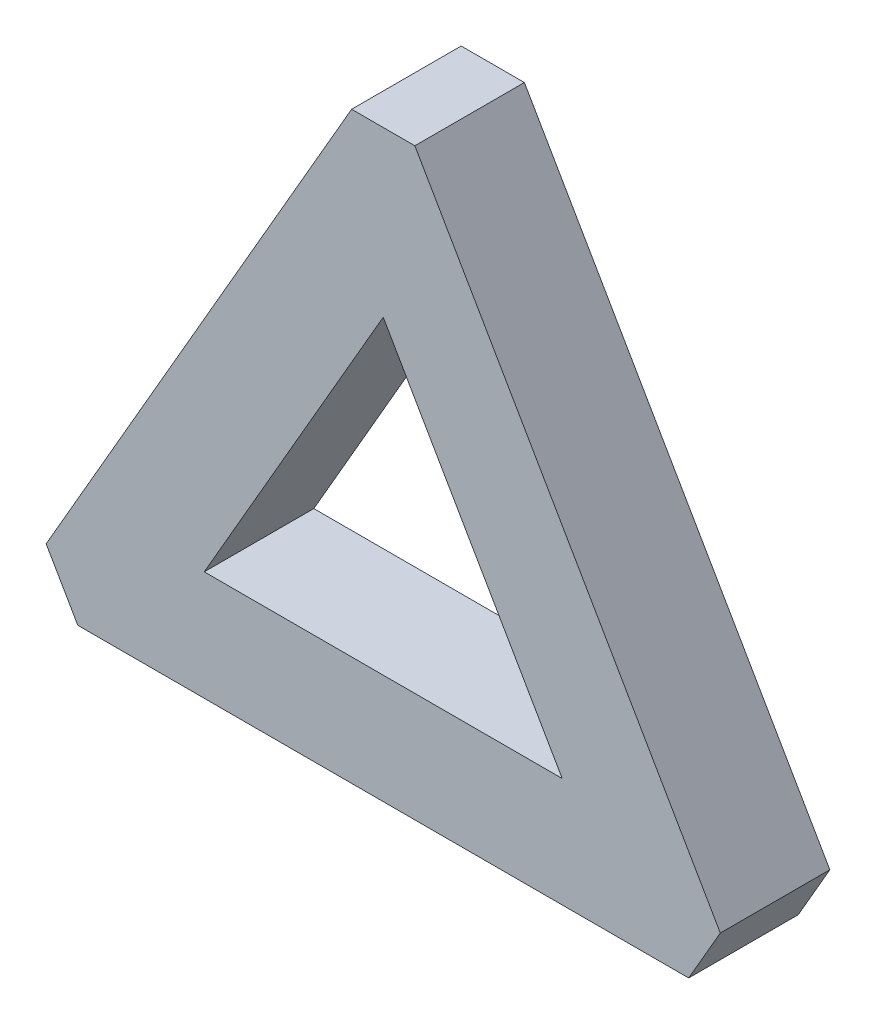
ISO-10303-21;
HEADER;
FILE_DESCRIPTION(('STEP AP214'),'2;1');
FILE_NAME('part.step','',(''),(''),'','','');
FILE_SCHEMA(('AUTOMOTIVE_DESIGN { 1 0 10303 214 1 1 1 1 }'));
ENDSEC;
DATA;
#1=APPLICATION_CONTEXT('core data for automotive mechanical design processes');
#2=APPLICATION_PROTOCOL_DEFINITION('international standard','automotive_design',2000,#1);
#3=PRODUCT_CONTEXT('',#1,'mechanical');
#4=PRODUCT('Part','Part','',(#3));
#5=PRODUCT_RELATED_PRODUCT_CATEGORY('part','',(#4));
#6=PRODUCT_DEFINITION_FORMATION('','',#4);
#7=PRODUCT_DEFINITION_CONTEXT('part definition',#1,'design');
#8=PRODUCT_DEFINITION('design','',#6,#7);
#9=PRODUCT_DEFINITION_SHAPE('','',#8);
#10=(LENGTH_UNIT() NAMED_UNIT(*) SI_UNIT(.MILLI.,.METRE.));
#11=(NAMED_UNIT(*) PLANE_ANGLE_UNIT() SI_UNIT($,.RADIAN.));
#12=(NAMED_UNIT(*) SI_UNIT($,.STERADIAN.) SOLID_ANGLE_UNIT());
#13=UNCERTAINTY_MEASURE_WITH_UNIT(LENGTH_MEASURE(1.E-05),#10,'distance_accuracy_value','');
#14=(GEOMETRIC_REPRESENTATION_CONTEXT(3) GLOBAL_UNCERTAINTY_ASSIGNED_CONTEXT((#13)) GLOBAL_UNIT_ASSIGNED_CONTEXT((#10,
#11,#12)) REPRESENTATION_CONTEXT('',''));
#15=CARTESIAN_POINT('',(0.,0.,0.));
#16=DIRECTION('',(0.,0.,1.));
#17=DIRECTION('',(1.,0.,0.));
#18=AXIS2_PLACEMENT_3D('',#15,#16,#17);
#19=CARTESIAN_POINT('',(0.,0.,20.));
#20=DIRECTION('',(0.,0.,-1.));
#21=DIRECTION('',(-1.,0.,0.));
#22=AXIS2_PLACEMENT_3D('',#19,#20,#21);
#23=PLANE('',#22);
#24=DIRECTION('',(-0.500000000000019,-0.866025403784428,0.));
#25=VECTOR('',#24,1.);
#26=CARTESIAN_POINT('',(-33.9109190674394,18.999592162799,20.));
#27=LINE('',#26,#25);
#28=CARTESIAN_POINT('',(-5.77350269189409,67.7350269189617,20.));
#29=VERTEX_POINT('',#28);
#30=CARTESIAN_POINT('',(-61.5470053837922,-28.8675134594806,20.));
#31=VERTEX_POINT('',#30);
#32=EDGE_CURVE('E132',#29,#31,#27,.T.);
#33=ORIENTED_EDGE('',*,*,#32,.T.);
#34=DIRECTION('',(0.499999999999981,-0.86602540378445,0.));
#35=VECTOR('',#34,1.);
#36=CARTESIAN_POINT('',(-55.7735026918959,-38.8675134594813,20.));
#37=LINE('',#36,#35);
#38=CARTESIAN_POINT('',(-55.7735026918959,-38.8675134594813,20.));
#39=VERTEX_POINT('',#38);
#40=EDGE_CURVE('E134',#31,#39,#37,.T.);
#41=ORIENTED_EDGE('',*,*,#40,.T.);
#42=DIRECTION('',(1.,0.,0.));
#43=VECTOR('',#42,1.);
#44=CARTESIAN_POINT('',(-55.7735026918959,-38.8675134594813,20.));
#45=LINE('',#44,#43);
#46=CARTESIAN_POINT('',(55.7735026918915,-38.8675134594815,20.));
#47=VERTEX_POINT('',#46);
#48=EDGE_CURVE('E137',#39,#47,#45,.T.);
#49=ORIENTED_EDGE('',*,*,#48,.T.);
#50=DIRECTION('',(0.499999999999974,0.866025403784454,0.));
#51=VECTOR('',#50,1.);
#52=CARTESIAN_POINT('',(61.5470053837876,-28.867513459481,20.));
#53=LINE('',#52,#51);
#54=CARTESIAN_POINT('',(61.5470053837876,-28.867513459481,20.));
#55=VERTEX_POINT('',#54);
#56=EDGE_CURVE('E139',#47,#55,#53,.T.);
#57=ORIENTED_EDGE('',*,*,#56,.T.);
#58=DIRECTION('',(-0.499999999999952,0.866025403784466,0.));
#59=VECTOR('',#58,1.);
#60=CARTESIAN_POINT('',(37.6336607224947,12.5516144727895,20.));
#61=LINE('',#60,#59);
#62=CARTESIAN_POINT('',(5.77350269189895,67.7350269189617,20.));
#63=VERTEX_POINT('',#62);
#64=EDGE_CURVE('E141',#55,#63,#61,.T.);
#65=ORIENTED_EDGE('',*,*,#64,.T.);
#66=DIRECTION('',(-1.,0.,0.));
#67=VECTOR('',#66,1.);
#68=CARTESIAN_POINT('',(-5.77350269189409,67.7350269189617,20.));
#69=LINE('',#68,#67);
#70=EDGE_CURVE('E143',#63,#29,#69,.T.);
#71=ORIENTED_EDGE('',*,*,#70,.T.);
#72=EDGE_LOOP('',(#33,#41,#49,#57,#65,#71));
#73=FACE_BOUND('',#72,.T.);
#74=DIRECTION('',(1.,0.,0.));
#75=VECTOR('',#74,1.);
#76=CARTESIAN_POINT('',(-32.6794919243116,-18.8675134594815,20.));
#77=LINE('',#76,#75);
#78=CARTESIAN_POINT('',(-32.6794919243116,-18.8675134594815,20.));
#79=VERTEX_POINT('',#78);
#80=CARTESIAN_POINT('',(32.6794919243099,-18.8675134594815,20.));
#81=VERTEX_POINT('',#80);
#82=EDGE_CURVE('E108',#79,#81,#77,.T.);
#83=ORIENTED_EDGE('',*,*,#82,.F.);
#84=DIRECTION('',(-0.499999999999994,-0.866025403784442,0.));
#85=VECTOR('',#84,1.);
#86=CARTESIAN_POINT('',(-16.9514396930097,8.37427210923084,20.));
#87=LINE('',#86,#85);
#88=CARTESIAN_POINT('',(-4.44089209850063E-13,37.7350269189631,20.));
#89=VERTEX_POINT('',#88);
#90=EDGE_CURVE('E103',#89,#79,#87,.T.);
#91=ORIENTED_EDGE('',*,*,#90,.F.);
#92=DIRECTION('',(-0.499999999999981,0.866025403784449,0.));
#93=VECTOR('',#92,1.);
#94=CARTESIAN_POINT('',(18.0973912545944,6.38942578155111,20.));
#95=LINE('',#94,#93);
#96=EDGE_CURVE('E121',#81,#89,#95,.T.);
#97=ORIENTED_EDGE('',*,*,#96,.F.);
#98=EDGE_LOOP('',(#83,#91,#97));
#99=FACE_BOUND('',#98,.T.);
#100=ADVANCED_FACE('F35',(#73,#99),#23,.F.);
#101=CARTESIAN_POINT('',(0.,0.,0.));
#102=DIRECTION('',(0.,0.,-1.));
#103=DIRECTION('',(-1.,0.,0.));
#104=AXIS2_PLACEMENT_3D('',#101,#102,#103);
#105=PLANE('',#104);
#106=DIRECTION('',(-0.500000000000019,-0.866025403784428,0.));
#107=VECTOR('',#106,1.);
#108=CARTESIAN_POINT('',(-33.9109190674394,18.999592162799,0.));
#109=LINE('',#108,#107);
#110=CARTESIAN_POINT('',(-5.77350269189409,67.7350269189617,0.));
#111=VERTEX_POINT('',#110);
#112=CARTESIAN_POINT('',(-61.5470053837922,-28.8675134594806,0.));
#113=VERTEX_POINT('',#112);
#114=EDGE_CURVE('E118',#111,#113,#109,.T.);
#115=ORIENTED_EDGE('',*,*,#114,.F.);
#116=DIRECTION('',(-1.,0.,0.));
#117=VECTOR('',#116,1.);
#118=CARTESIAN_POINT('',(-5.77350269189409,67.7350269189617,0.));
#119=LINE('',#118,#117);
#120=CARTESIAN_POINT('',(5.77350269189895,67.7350269189617,0.));
#121=VERTEX_POINT('',#120);
#122=EDGE_CURVE('E135',#121,#111,#119,.T.);
#123=ORIENTED_EDGE('',*,*,#122,.F.);
#124=DIRECTION('',(-0.499999999999955,0.866025403784465,0.));
#125=VECTOR('',#124,1.);
#126=CARTESIAN_POINT('',(5.77350269189895,67.7350269189617,0.));
#127=LINE('',#126,#125);
#128=CARTESIAN_POINT('',(61.5470053837876,-28.867513459481,0.));
#129=VERTEX_POINT('',#128);
#130=EDGE_CURVE('E155',#129,#121,#127,.T.);
#131=ORIENTED_EDGE('',*,*,#130,.F.);
#132=DIRECTION('',(0.499999999999974,0.866025403784454,0.));
#133=VECTOR('',#132,1.);
#134=CARTESIAN_POINT('',(61.5470053837876,-28.867513459481,0.));
#135=LINE('',#134,#133);
#136=CARTESIAN_POINT('',(55.7735026918915,-38.8675134594815,0.));
#137=VERTEX_POINT('',#136);
#138=EDGE_CURVE('E152',#137,#129,#135,.T.);
#139=ORIENTED_EDGE('',*,*,#138,.F.);
#140=DIRECTION('',(1.,0.,0.));
#141=VECTOR('',#140,1.);
#142=CARTESIAN_POINT('',(55.7735026918915,-38.8675134594815,0.));
#143=LINE('',#142,#141);
#144=CARTESIAN_POINT('',(-55.7735026918959,-38.8675134594813,0.));
#145=VERTEX_POINT('',#144);
#146=EDGE_CURVE('E150',#145,#137,#143,.T.);
#147=ORIENTED_EDGE('',*,*,#146,.F.);
#148=DIRECTION('',(0.499999999999981,-0.86602540378445,0.));
#149=VECTOR('',#148,1.);
#150=CARTESIAN_POINT('',(-55.7735026918959,-38.8675134594813,0.));
#151=LINE('',#150,#149);
#152=EDGE_CURVE('E147',#113,#145,#151,.T.);
#153=ORIENTED_EDGE('',*,*,#152,.F.);
#154=EDGE_LOOP('',(#115,#123,#131,#139,#147,#153));
#155=FACE_BOUND('',#154,.T.);
#156=DIRECTION('',(-0.499999999999994,-0.866025403784442,0.));
#157=VECTOR('',#156,1.);
#158=CARTESIAN_POINT('',(-16.9514396930097,8.37427210923084,0.));
#159=LINE('',#158,#157);
#160=CARTESIAN_POINT('',(-4.42861217731331E-13,37.7350269189631,0.));
#161=VERTEX_POINT('',#160);
#162=CARTESIAN_POINT('',(-32.6794919243116,-18.8675134594815,0.));
#163=VERTEX_POINT('',#162);
#164=EDGE_CURVE('E109',#161,#163,#159,.T.);
#165=ORIENTED_EDGE('',*,*,#164,.T.);
#166=DIRECTION('',(1.,0.,0.));
#167=VECTOR('',#166,1.);
#168=CARTESIAN_POINT('',(32.6794919243099,-18.8675134594815,0.));
#169=LINE('',#168,#167);
#170=CARTESIAN_POINT('',(32.6794919243099,-18.8675134594815,0.));
#171=VERTEX_POINT('',#170);
#172=EDGE_CURVE('E116',#163,#171,#169,.T.);
#173=ORIENTED_EDGE('',*,*,#172,.T.);
#174=DIRECTION('',(-0.499999999999987,0.866025403784446,0.));
#175=VECTOR('',#174,1.);
#176=CARTESIAN_POINT('',(-4.42861217731331E-13,37.7350269189631,0.));
#177=LINE('',#176,#175);
#178=EDGE_CURVE('E126',#171,#161,#177,.T.);
#179=ORIENTED_EDGE('',*,*,#178,.T.);
#180=EDGE_LOOP('',(#165,#173,#179));
#181=FACE_BOUND('',#180,.T.);
#182=ADVANCED_FACE('F181',(#155,#181),#105,.T.);
#183=CARTESIAN_POINT('',(-33.9109190674394,18.999592162799,20.));
#184=DIRECTION('',(0.866025403784428,-0.500000000000019,0.));
#185=DIRECTION('',(0.500000000000019,0.866025403784428,0.));
#186=AXIS2_PLACEMENT_3D('',#183,#184,#185);
#187=PLANE('',#186);
#188=ORIENTED_EDGE('',*,*,#114,.T.);
#189=DIRECTION('',(0.,0.,-1.));
#190=VECTOR('',#189,1.);
#191=CARTESIAN_POINT('',(-61.5470053837922,-28.8675134594806,20.));
#192=LINE('',#191,#190);
#193=EDGE_CURVE('E11',#31,#113,#192,.T.);
#194=ORIENTED_EDGE('',*,*,#193,.F.);
#195=ORIENTED_EDGE('',*,*,#32,.F.);
#196=DIRECTION('',(0.,0.,-1.));
#197=VECTOR('',#196,1.);
#198=CARTESIAN_POINT('',(-5.77350269189409,67.7350269189617,20.));
#199=LINE('',#198,#197);
#200=EDGE_CURVE('E145',#29,#111,#199,.T.);
#201=ORIENTED_EDGE('',*,*,#200,.T.);
#202=EDGE_LOOP('',(#188,#194,#195,#201));
#203=FACE_BOUND('',#202,.T.);
#204=ADVANCED_FACE('F37',(#203),#187,.F.);
#205=CARTESIAN_POINT('',(-55.7735026918959,-38.8675134594813,20.));
#206=DIRECTION('',(0.86602540378445,0.499999999999981,0.));
#207=DIRECTION('',(-0.499999999999981,0.86602540378445,0.));
#208=AXIS2_PLACEMENT_3D('',#205,#206,#207);
#209=PLANE('',#208);
#210=ORIENTED_EDGE('',*,*,#152,.T.);
#211=DIRECTION('',(0.,0.,-1.));
#212=VECTOR('',#211,1.);
#213=CARTESIAN_POINT('',(-55.7735026918959,-38.8675134594813,20.));
#214=LINE('',#213,#212);
#215=EDGE_CURVE('E43',#39,#145,#214,.T.);
#216=ORIENTED_EDGE('',*,*,#215,.F.);
#217=ORIENTED_EDGE('',*,*,#40,.F.);
#218=ORIENTED_EDGE('',*,*,#193,.T.);
#219=EDGE_LOOP('',(#210,#216,#217,#218));
#220=FACE_BOUND('',#219,.T.);
#221=ADVANCED_FACE('F177',(#220),#209,.F.);
#222=CARTESIAN_POINT('',(55.7735026918915,-38.8675134594815,20.));
#223=DIRECTION('',(0.,1.,0.));
#224=DIRECTION('',(-1.,0.,0.));
#225=AXIS2_PLACEMENT_3D('',#222,#223,#224);
#226=PLANE('',#225);
#227=ORIENTED_EDGE('',*,*,#146,.T.);
#228=DIRECTION('',(0.,0.,-1.));
#229=VECTOR('',#228,1.);
#230=CARTESIAN_POINT('',(55.7735026918915,-38.8675134594815,20.));
#231=LINE('',#230,#229);
#232=EDGE_CURVE('E167',#47,#137,#231,.T.);
#233=ORIENTED_EDGE('',*,*,#232,.F.);
#234=ORIENTED_EDGE('',*,*,#48,.F.);
#235=ORIENTED_EDGE('',*,*,#215,.T.);
#236=EDGE_LOOP('',(#227,#233,#234,#235));
#237=FACE_BOUND('',#236,.T.);
#238=ADVANCED_FACE('F173',(#237),#226,.F.);
#239=CARTESIAN_POINT('',(61.5470053837876,-28.867513459481,20.));
#240=DIRECTION('',(-0.866025403784454,0.499999999999974,0.));
#241=DIRECTION('',(-0.499999999999974,-0.866025403784454,0.));
#242=AXIS2_PLACEMENT_3D('',#239,#240,#241);
#243=PLANE('',#242);
#244=ORIENTED_EDGE('',*,*,#138,.T.);
#245=DIRECTION('',(0.,0.,-1.));
#246=VECTOR('',#245,1.);
#247=CARTESIAN_POINT('',(61.5470053837876,-28.867513459481,20.));
#248=LINE('',#247,#246);
#249=EDGE_CURVE('E164',#55,#129,#248,.T.);
#250=ORIENTED_EDGE('',*,*,#249,.F.);
#251=ORIENTED_EDGE('',*,*,#56,.F.);
#252=ORIENTED_EDGE('',*,*,#232,.T.);
#253=EDGE_LOOP('',(#244,#250,#251,#252));
#254=FACE_BOUND('',#253,.T.);
#255=ADVANCED_FACE('F187',(#254),#243,.F.);
#256=CARTESIAN_POINT('',(5.77350269189895,67.7350269189617,20.));
#257=DIRECTION('',(-0.866025403784465,-0.499999999999955,0.));
#258=DIRECTION('',(0.499999999999955,-0.866025403784465,0.));
#259=AXIS2_PLACEMENT_3D('',#256,#257,#258);
#260=PLANE('',#259);
#261=ORIENTED_EDGE('',*,*,#130,.T.);
#262=DIRECTION('',(0.,0.,-1.));
#263=VECTOR('',#262,1.);
#264=CARTESIAN_POINT('',(5.77350269189895,67.7350269189617,20.));
#265=LINE('',#264,#263);
#266=EDGE_CURVE('E161',#63,#121,#265,.T.);
#267=ORIENTED_EDGE('',*,*,#266,.F.);
#268=ORIENTED_EDGE('',*,*,#64,.F.);
#269=ORIENTED_EDGE('',*,*,#249,.T.);
#270=EDGE_LOOP('',(#261,#267,#268,#269));
#271=FACE_BOUND('',#270,.T.);
#272=ADVANCED_FACE('F191',(#271),#260,.F.);
#273=CARTESIAN_POINT('',(-5.77350269189409,67.7350269189617,20.));
#274=DIRECTION('',(0.,-1.,0.));
#275=DIRECTION('',(0.,0.,-1.));
#276=AXIS2_PLACEMENT_3D('',#273,#274,#275);
#277=PLANE('',#276);
#278=ORIENTED_EDGE('',*,*,#122,.T.);
#279=ORIENTED_EDGE('',*,*,#200,.F.);
#280=ORIENTED_EDGE('',*,*,#70,.F.);
#281=ORIENTED_EDGE('',*,*,#266,.T.);
#282=EDGE_LOOP('',(#278,#279,#280,#281));
#283=FACE_BOUND('',#282,.T.);
#284=ADVANCED_FACE('F199',(#283),#277,.F.);
#285=CARTESIAN_POINT('',(32.6794919243099,-18.8675134594815,20.));
#286=DIRECTION('',(0.,1.,0.));
#287=DIRECTION('',(-1.,0.,0.));
#288=AXIS2_PLACEMENT_3D('',#285,#286,#287);
#289=PLANE('',#288);
#290=ORIENTED_EDGE('',*,*,#172,.F.);
#291=DIRECTION('',(0.,0.,-1.));
#292=VECTOR('',#291,1.);
#293=CARTESIAN_POINT('',(-32.6794919243116,-18.8675134594815,20.));
#294=LINE('',#293,#292);
#295=EDGE_CURVE('E55',#79,#163,#294,.T.);
#296=ORIENTED_EDGE('',*,*,#295,.F.);
#297=ORIENTED_EDGE('',*,*,#82,.T.);
#298=DIRECTION('',(0.,0.,-1.));
#299=VECTOR('',#298,1.);
#300=CARTESIAN_POINT('',(32.6794919243099,-18.8675134594815,20.));
#301=LINE('',#300,#299);
#302=EDGE_CURVE('E119',#81,#171,#301,.T.);
#303=ORIENTED_EDGE('',*,*,#302,.T.);
#304=EDGE_LOOP('',(#290,#296,#297,#303));
#305=FACE_BOUND('',#304,.T.);
#306=ADVANCED_FACE('F112',(#305),#289,.T.);
#307=CARTESIAN_POINT('',(-4.42861217731331E-13,37.7350269189631,20.));
#308=DIRECTION('',(-0.866025403784446,-0.499999999999987,0.));
#309=DIRECTION('',(0.499999999999987,-0.866025403784446,0.));
#310=AXIS2_PLACEMENT_3D('',#307,#308,#309);
#311=PLANE('',#310);
#312=ORIENTED_EDGE('',*,*,#178,.F.);
#313=ORIENTED_EDGE('',*,*,#302,.F.);
#314=ORIENTED_EDGE('',*,*,#96,.T.);
#315=DIRECTION('',(0.,0.,-1.));
#316=VECTOR('',#315,1.);
#317=CARTESIAN_POINT('',(-4.42861217731331E-13,37.7350269189631,20.));
#318=LINE('',#317,#316);
#319=EDGE_CURVE('E50',#89,#161,#318,.T.);
#320=ORIENTED_EDGE('',*,*,#319,.T.);
#321=EDGE_LOOP('',(#312,#313,#314,#320));
#322=FACE_BOUND('',#321,.T.);
#323=ADVANCED_FACE('F206',(#322),#311,.T.);
#324=CARTESIAN_POINT('',(-16.9514396930097,8.37427210923084,20.));
#325=DIRECTION('',(0.866025403784442,-0.499999999999994,0.));
#326=DIRECTION('',(0.499999999999994,0.866025403784442,0.));
#327=AXIS2_PLACEMENT_3D('',#324,#325,#326);
#328=PLANE('',#327);
#329=ORIENTED_EDGE('',*,*,#164,.F.);
#330=ORIENTED_EDGE('',*,*,#319,.F.);
#331=ORIENTED_EDGE('',*,*,#90,.T.);
#332=ORIENTED_EDGE('',*,*,#295,.T.);
#333=EDGE_LOOP('',(#329,#330,#331,#332));
#334=FACE_BOUND('',#333,.T.);
#335=ADVANCED_FACE('F104',(#334),#328,.T.);
#336=CLOSED_SHELL('',(#100,#182,#204,#221,#238,#255,#272,#284,#306,#323,#335));
#337=MANIFOLD_SOLID_BREP('B2',#336);
#338=ADVANCED_BREP_SHAPE_REPRESENTATION('',(#18,#337),#14);
#339=SHAPE_DEFINITION_REPRESENTATION(#9,#338);
ENDSEC;
END-ISO-10303-21;
